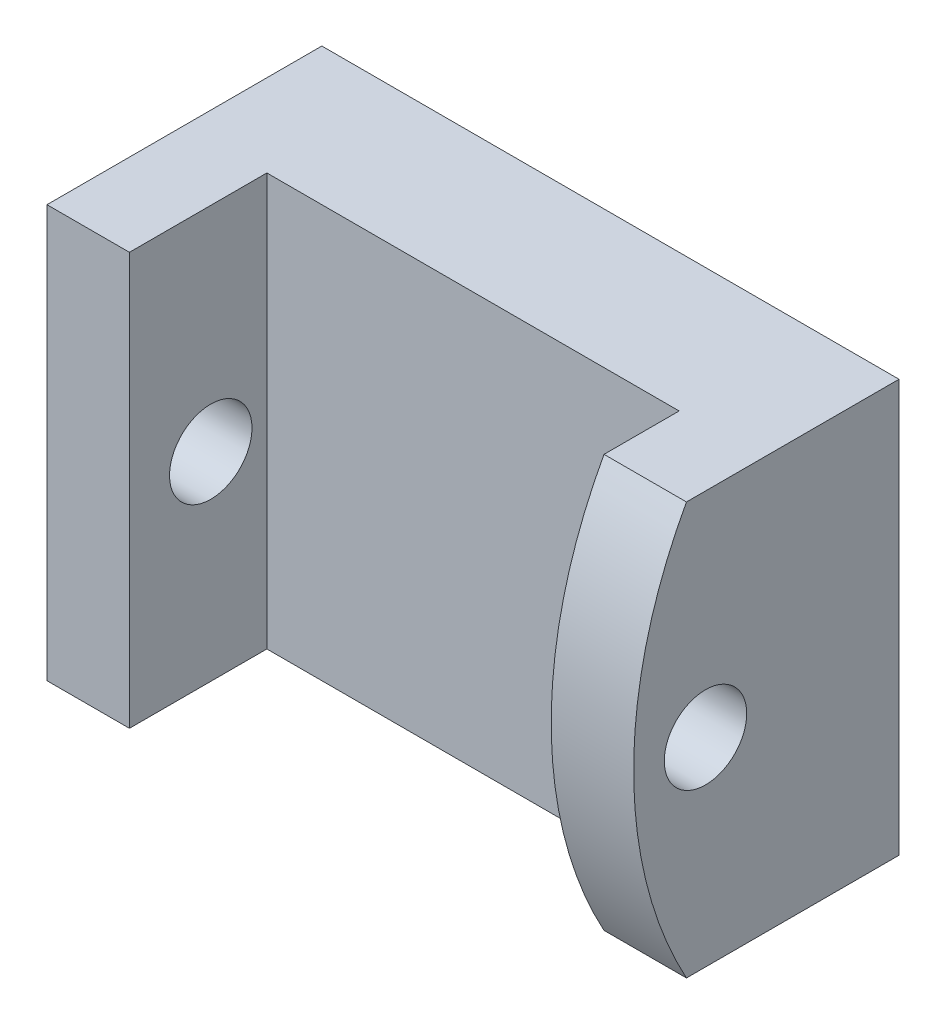
ISO-10303-21;
HEADER;
FILE_DESCRIPTION(('STEP AP214'),'2;1');
FILE_NAME('part.step','',(''),(''),'','','');
FILE_SCHEMA(('AUTOMOTIVE_DESIGN { 1 0 10303 214 1 1 1 1 }'));
ENDSEC;
DATA;
#1=APPLICATION_CONTEXT('core data for automotive mechanical design processes');
#2=APPLICATION_PROTOCOL_DEFINITION('international standard','automotive_design',2000,#1);
#3=PRODUCT_CONTEXT('',#1,'mechanical');
#4=PRODUCT('Part','Part','',(#3));
#5=PRODUCT_RELATED_PRODUCT_CATEGORY('part','',(#4));
#6=PRODUCT_DEFINITION_FORMATION('','',#4);
#7=PRODUCT_DEFINITION_CONTEXT('part definition',#1,'design');
#8=PRODUCT_DEFINITION('design','',#6,#7);
#9=PRODUCT_DEFINITION_SHAPE('','',#8);
#10=(LENGTH_UNIT() NAMED_UNIT(*) SI_UNIT(.MILLI.,.METRE.));
#11=(NAMED_UNIT(*) PLANE_ANGLE_UNIT() SI_UNIT($,.RADIAN.));
#12=(NAMED_UNIT(*) SI_UNIT($,.STERADIAN.) SOLID_ANGLE_UNIT());
#13=UNCERTAINTY_MEASURE_WITH_UNIT(LENGTH_MEASURE(1.E-05),#10,'distance_accuracy_value','');
#14=(GEOMETRIC_REPRESENTATION_CONTEXT(3) GLOBAL_UNCERTAINTY_ASSIGNED_CONTEXT((#13)) GLOBAL_UNIT_ASSIGNED_CONTEXT((#10,
#11,#12)) REPRESENTATION_CONTEXT('',''));
#15=CARTESIAN_POINT('',(0.,0.,0.));
#16=DIRECTION('',(0.,0.,1.));
#17=DIRECTION('',(1.,0.,0.));
#18=AXIS2_PLACEMENT_3D('',#15,#16,#17);
#19=CARTESIAN_POINT('',(0.,0.,5.));
#20=DIRECTION('',(-1.,0.,0.));
#21=DIRECTION('',(0.,0.,1.));
#22=AXIS2_PLACEMENT_3D('',#19,#20,#21);
#23=PLANE('',#22);
#24=CARTESIAN_POINT('',(0.,-7.76248029614629,7.04138911613754));
#25=DIRECTION('',(1.,0.,0.));
#26=DIRECTION('',(0.,0.,-1.));
#27=AXIS2_PLACEMENT_3D('',#24,#25,#26);
#28=CIRCLE('',#27,1.5);
#29=CARTESIAN_POINT('',(0.,-7.76248029614629,5.54138911613754));
#30=VERTEX_POINT('',#29);
#31=EDGE_CURVE('E207',#30,#30,#28,.T.);
#32=ORIENTED_EDGE('',*,*,#31,.F.);
#33=EDGE_LOOP('',(#32));
#34=FACE_BOUND('',#33,.T.);
#35=CARTESIAN_POINT('',(0.,-7.5,-5.94512453601259));
#36=DIRECTION('',(1.,0.,0.));
#37=DIRECTION('',(0.,0.,-1.));
#38=AXIS2_PLACEMENT_3D('',#35,#36,#37);
#39=CIRCLE('',#38,15.5999742941684);
#40=CARTESIAN_POINT('',(0.,0.,7.73366188598822));
#41=VERTEX_POINT('',#40);
#42=CARTESIAN_POINT('',(0.,-15.,7.73366188598822));
#43=VERTEX_POINT('',#42);
#44=EDGE_CURVE('E103',#41,#43,#39,.T.);
#45=ORIENTED_EDGE('',*,*,#44,.T.);
#46=DIRECTION('',(0.,0.,-1.));
#47=VECTOR('',#46,1.);
#48=CARTESIAN_POINT('',(0.,-15.,5.));
#49=LINE('',#48,#47);
#50=CARTESIAN_POINT('',(0.,-15.,0.));
#51=VERTEX_POINT('',#50);
#52=EDGE_CURVE('E120',#43,#51,#49,.T.);
#53=ORIENTED_EDGE('',*,*,#52,.T.);
#54=DIRECTION('',(0.,1.,0.));
#55=VECTOR('',#54,1.);
#56=CARTESIAN_POINT('',(0.,0.,0.));
#57=LINE('',#56,#55);
#58=CARTESIAN_POINT('',(0.,0.,0.));
#59=VERTEX_POINT('',#58);
#60=EDGE_CURVE('E119',#51,#59,#57,.T.);
#61=ORIENTED_EDGE('',*,*,#60,.T.);
#62=DIRECTION('',(0.,0.,-1.));
#63=VECTOR('',#62,1.);
#64=CARTESIAN_POINT('',(0.,0.,5.));
#65=LINE('',#64,#63);
#66=EDGE_CURVE('E11',#41,#59,#65,.T.);
#67=ORIENTED_EDGE('',*,*,#66,.F.);
#68=EDGE_LOOP('',(#45,#53,#61,#67));
#69=FACE_BOUND('',#68,.T.);
#70=ADVANCED_FACE('F39',(#34,#69),#23,.F.);
#71=CARTESIAN_POINT('',(0.,0.,5.));
#72=DIRECTION('',(0.,-1.,0.));
#73=DIRECTION('',(1.,0.,0.));
#74=AXIS2_PLACEMENT_3D('',#71,#72,#73);
#75=PLANE('',#74);
#76=DIRECTION('',(1.,0.,0.));
#77=VECTOR('',#76,1.);
#78=CARTESIAN_POINT('',(-18.,0.,7.73366188598822));
#79=LINE('',#78,#77);
#80=CARTESIAN_POINT('',(-3.,0.,7.73366188598822));
#81=VERTEX_POINT('',#80);
#82=EDGE_CURVE('E54',#81,#41,#79,.T.);
#83=ORIENTED_EDGE('',*,*,#82,.T.);
#84=ORIENTED_EDGE('',*,*,#66,.T.);
#85=DIRECTION('',(-1.,0.,0.));
#86=VECTOR('',#85,1.);
#87=CARTESIAN_POINT('',(0.,0.,0.));
#88=LINE('',#87,#86);
#89=CARTESIAN_POINT('',(-21.,0.,0.));
#90=VERTEX_POINT('',#89);
#91=EDGE_CURVE('E124',#59,#90,#88,.T.);
#92=ORIENTED_EDGE('',*,*,#91,.T.);
#93=DIRECTION('',(0.,0.,-1.));
#94=VECTOR('',#93,1.);
#95=CARTESIAN_POINT('',(-21.,0.,5.));
#96=LINE('',#95,#94);
#97=CARTESIAN_POINT('',(-21.,0.,10.));
#98=VERTEX_POINT('',#97);
#99=EDGE_CURVE('E47',#98,#90,#96,.T.);
#100=ORIENTED_EDGE('',*,*,#99,.F.);
#101=DIRECTION('',(-1.,0.,0.));
#102=VECTOR('',#101,1.);
#103=CARTESIAN_POINT('',(-21.,0.,10.));
#104=LINE('',#103,#102);
#105=CARTESIAN_POINT('',(-18.,0.,10.));
#106=VERTEX_POINT('',#105);
#107=EDGE_CURVE('E163',#106,#98,#104,.T.);
#108=ORIENTED_EDGE('',*,*,#107,.F.);
#109=DIRECTION('',(0.,0.,-1.));
#110=VECTOR('',#109,1.);
#111=CARTESIAN_POINT('',(-18.,0.,10.));
#112=LINE('',#111,#110);
#113=CARTESIAN_POINT('',(-18.,0.,5.));
#114=VERTEX_POINT('',#113);
#115=EDGE_CURVE('E62',#106,#114,#112,.T.);
#116=ORIENTED_EDGE('',*,*,#115,.T.);
#117=DIRECTION('',(-1.,0.,0.));
#118=VECTOR('',#117,1.);
#119=CARTESIAN_POINT('',(0.,0.,5.));
#120=LINE('',#119,#118);
#121=CARTESIAN_POINT('',(-3.,0.,5.));
#122=VERTEX_POINT('',#121);
#123=EDGE_CURVE('E137',#122,#114,#120,.T.);
#124=ORIENTED_EDGE('',*,*,#123,.F.);
#125=DIRECTION('',(0.,0.,-1.));
#126=VECTOR('',#125,1.);
#127=CARTESIAN_POINT('',(-3.,0.,10.));
#128=LINE('',#127,#126);
#129=EDGE_CURVE('E115',#81,#122,#128,.T.);
#130=ORIENTED_EDGE('',*,*,#129,.F.);
#131=EDGE_LOOP('',(#83,#84,#92,#100,#108,#116,#124,#130));
#132=FACE_BOUND('',#131,.T.);
#133=ADVANCED_FACE('F113',(#132),#75,.F.);
#134=CARTESIAN_POINT('',(0.,-15.,5.));
#135=DIRECTION('',(0.,1.,0.));
#136=DIRECTION('',(-1.,0.,0.));
#137=AXIS2_PLACEMENT_3D('',#134,#135,#136);
#138=PLANE('',#137);
#139=DIRECTION('',(1.,0.,0.));
#140=VECTOR('',#139,1.);
#141=CARTESIAN_POINT('',(-18.,-15.,7.73366188598822));
#142=LINE('',#141,#140);
#143=CARTESIAN_POINT('',(-3.,-15.,7.73366188598822));
#144=VERTEX_POINT('',#143);
#145=EDGE_CURVE('E106',#144,#43,#142,.T.);
#146=ORIENTED_EDGE('',*,*,#145,.F.);
#147=DIRECTION('',(0.,0.,-1.));
#148=VECTOR('',#147,1.);
#149=CARTESIAN_POINT('',(-3.,-15.,10.));
#150=LINE('',#149,#148);
#151=CARTESIAN_POINT('',(-3.,-15.,5.));
#152=VERTEX_POINT('',#151);
#153=EDGE_CURVE('E125',#144,#152,#150,.T.);
#154=ORIENTED_EDGE('',*,*,#153,.T.);
#155=DIRECTION('',(1.,0.,0.));
#156=VECTOR('',#155,1.);
#157=CARTESIAN_POINT('',(0.,-15.,5.));
#158=LINE('',#157,#156);
#159=CARTESIAN_POINT('',(-18.,-15.,5.));
#160=VERTEX_POINT('',#159);
#161=EDGE_CURVE('E131',#160,#152,#158,.T.);
#162=ORIENTED_EDGE('',*,*,#161,.F.);
#163=DIRECTION('',(0.,0.,-1.));
#164=VECTOR('',#163,1.);
#165=CARTESIAN_POINT('',(-18.,-15.,10.));
#166=LINE('',#165,#164);
#167=CARTESIAN_POINT('',(-18.,-15.,10.));
#168=VERTEX_POINT('',#167);
#169=EDGE_CURVE('E157',#168,#160,#166,.T.);
#170=ORIENTED_EDGE('',*,*,#169,.F.);
#171=DIRECTION('',(1.,0.,0.));
#172=VECTOR('',#171,1.);
#173=CARTESIAN_POINT('',(-21.,-15.,10.));
#174=LINE('',#173,#172);
#175=CARTESIAN_POINT('',(-21.,-15.,10.));
#176=VERTEX_POINT('',#175);
#177=EDGE_CURVE('E155',#176,#168,#174,.T.);
#178=ORIENTED_EDGE('',*,*,#177,.F.);
#179=DIRECTION('',(0.,0.,-1.));
#180=VECTOR('',#179,1.);
#181=CARTESIAN_POINT('',(-21.,-15.,5.));
#182=LINE('',#181,#180);
#183=CARTESIAN_POINT('',(-21.,-15.,0.));
#184=VERTEX_POINT('',#183);
#185=EDGE_CURVE('E139',#176,#184,#182,.T.);
#186=ORIENTED_EDGE('',*,*,#185,.T.);
#187=DIRECTION('',(1.,0.,0.));
#188=VECTOR('',#187,1.);
#189=CARTESIAN_POINT('',(0.,-15.,0.));
#190=LINE('',#189,#188);
#191=EDGE_CURVE('E135',#184,#51,#190,.T.);
#192=ORIENTED_EDGE('',*,*,#191,.T.);
#193=ORIENTED_EDGE('',*,*,#52,.F.);
#194=EDGE_LOOP('',(#146,#154,#162,#170,#178,#186,#192,#193));
#195=FACE_BOUND('',#194,.T.);
#196=ADVANCED_FACE('F152',(#195),#138,.F.);
#197=CARTESIAN_POINT('',(-3.,0.,10.));
#198=DIRECTION('',(1.,0.,0.));
#199=DIRECTION('',(0.,1.,0.));
#200=AXIS2_PLACEMENT_3D('',#197,#198,#199);
#201=PLANE('',#200);
#202=CARTESIAN_POINT('',(-3.,-7.76248029614629,7.04138911613754));
#203=DIRECTION('',(1.,0.,0.));
#204=DIRECTION('',(0.,1.,0.));
#205=AXIS2_PLACEMENT_3D('',#202,#203,#204);
#206=CIRCLE('',#205,1.5);
#207=CARTESIAN_POINT('',(-3.,-6.26248029614629,7.04138911613754));
#208=VERTEX_POINT('',#207);
#209=EDGE_CURVE('E110',#208,#208,#206,.T.);
#210=ORIENTED_EDGE('',*,*,#209,.T.);
#211=EDGE_LOOP('',(#210));
#212=FACE_BOUND('',#211,.T.);
#213=CARTESIAN_POINT('',(-3.,-7.5,-5.94512453601259));
#214=DIRECTION('',(1.,0.,0.));
#215=DIRECTION('',(0.,1.,0.));
#216=AXIS2_PLACEMENT_3D('',#213,#214,#215);
#217=CIRCLE('',#216,15.5999742941684);
#218=EDGE_CURVE('E181',#81,#144,#217,.T.);
#219=ORIENTED_EDGE('',*,*,#218,.F.);
#220=ORIENTED_EDGE('',*,*,#129,.T.);
#221=DIRECTION('',(0.,-1.,0.));
#222=VECTOR('',#221,1.);
#223=CARTESIAN_POINT('',(-3.,0.,5.));
#224=LINE('',#223,#222);
#225=EDGE_CURVE('E167',#122,#152,#224,.T.);
#226=ORIENTED_EDGE('',*,*,#225,.T.);
#227=ORIENTED_EDGE('',*,*,#153,.F.);
#228=EDGE_LOOP('',(#219,#220,#226,#227));
#229=FACE_BOUND('',#228,.T.);
#230=ADVANCED_FACE('F180',(#212,#229),#201,.F.);
#231=CARTESIAN_POINT('',(0.,0.,5.));
#232=DIRECTION('',(0.,0.,-1.));
#233=DIRECTION('',(-1.,0.,0.));
#234=AXIS2_PLACEMENT_3D('',#231,#232,#233);
#235=PLANE('',#234);
#236=DIRECTION('',(0.,1.,0.));
#237=VECTOR('',#236,1.);
#238=CARTESIAN_POINT('',(-18.,0.,5.));
#239=LINE('',#238,#237);
#240=EDGE_CURVE('E164',#160,#114,#239,.T.);
#241=ORIENTED_EDGE('',*,*,#240,.F.);
#242=ORIENTED_EDGE('',*,*,#161,.T.);
#243=ORIENTED_EDGE('',*,*,#225,.F.);
#244=ORIENTED_EDGE('',*,*,#123,.T.);
#245=EDGE_LOOP('',(#241,#242,#243,#244));
#246=FACE_BOUND('',#245,.T.);
#247=ADVANCED_FACE('F177',(#246),#235,.F.);
#248=CARTESIAN_POINT('',(-21.,0.,5.));
#249=DIRECTION('',(1.,0.,0.));
#250=DIRECTION('',(0.,1.,0.));
#251=AXIS2_PLACEMENT_3D('',#248,#249,#250);
#252=PLANE('',#251);
#253=CARTESIAN_POINT('',(-21.,-7.76248029614629,7.04138911613754));
#254=DIRECTION('',(1.,0.,0.));
#255=DIRECTION('',(0.,0.,-1.));
#256=AXIS2_PLACEMENT_3D('',#253,#254,#255);
#257=CIRCLE('',#256,1.5);
#258=CARTESIAN_POINT('',(-21.,-7.76248029614629,5.54138911613754));
#259=VERTEX_POINT('',#258);
#260=EDGE_CURVE('E209',#259,#259,#257,.T.);
#261=ORIENTED_EDGE('',*,*,#260,.T.);
#262=EDGE_LOOP('',(#261));
#263=FACE_BOUND('',#262,.T.);
#264=DIRECTION('',(0.,-1.,0.));
#265=VECTOR('',#264,1.);
#266=CARTESIAN_POINT('',(-21.,0.,0.));
#267=LINE('',#266,#265);
#268=EDGE_CURVE('E127',#90,#184,#267,.T.);
#269=ORIENTED_EDGE('',*,*,#268,.T.);
#270=ORIENTED_EDGE('',*,*,#185,.F.);
#271=DIRECTION('',(0.,-1.,0.));
#272=VECTOR('',#271,1.);
#273=CARTESIAN_POINT('',(-21.,0.,10.));
#274=LINE('',#273,#272);
#275=EDGE_CURVE('E148',#98,#176,#274,.T.);
#276=ORIENTED_EDGE('',*,*,#275,.F.);
#277=ORIENTED_EDGE('',*,*,#99,.T.);
#278=EDGE_LOOP('',(#269,#270,#276,#277));
#279=FACE_BOUND('',#278,.T.);
#280=ADVANCED_FACE('F146',(#263,#279),#252,.F.);
#281=CARTESIAN_POINT('',(0.,0.,0.));
#282=DIRECTION('',(0.,0.,-1.));
#283=DIRECTION('',(-1.,0.,0.));
#284=AXIS2_PLACEMENT_3D('',#281,#282,#283);
#285=PLANE('',#284);
#286=ORIENTED_EDGE('',*,*,#60,.F.);
#287=ORIENTED_EDGE('',*,*,#191,.F.);
#288=ORIENTED_EDGE('',*,*,#268,.F.);
#289=ORIENTED_EDGE('',*,*,#91,.F.);
#290=EDGE_LOOP('',(#286,#287,#288,#289));
#291=FACE_BOUND('',#290,.T.);
#292=ADVANCED_FACE('F150',(#291),#285,.T.);
#293=CARTESIAN_POINT('',(-18.,0.,10.));
#294=DIRECTION('',(-1.,0.,0.));
#295=DIRECTION('',(0.,0.,1.));
#296=AXIS2_PLACEMENT_3D('',#293,#294,#295);
#297=PLANE('',#296);
#298=CARTESIAN_POINT('',(-18.,-7.76248029614629,7.04138911613754));
#299=DIRECTION('',(-1.,0.,0.));
#300=DIRECTION('',(0.,0.,1.));
#301=AXIS2_PLACEMENT_3D('',#298,#299,#300);
#302=CIRCLE('',#301,1.5);
#303=CARTESIAN_POINT('',(-18.,-7.76248029614629,8.54138911613754));
#304=VERTEX_POINT('',#303);
#305=EDGE_CURVE('E42',#304,#304,#302,.T.);
#306=ORIENTED_EDGE('',*,*,#305,.T.);
#307=EDGE_LOOP('',(#306));
#308=FACE_BOUND('',#307,.T.);
#309=ORIENTED_EDGE('',*,*,#169,.T.);
#310=ORIENTED_EDGE('',*,*,#240,.T.);
#311=ORIENTED_EDGE('',*,*,#115,.F.);
#312=DIRECTION('',(0.,1.,0.));
#313=VECTOR('',#312,1.);
#314=CARTESIAN_POINT('',(-18.,0.,10.));
#315=LINE('',#314,#313);
#316=EDGE_CURVE('E160',#168,#106,#315,.T.);
#317=ORIENTED_EDGE('',*,*,#316,.F.);
#318=EDGE_LOOP('',(#309,#310,#311,#317));
#319=FACE_BOUND('',#318,.T.);
#320=ADVANCED_FACE('F188',(#308,#319),#297,.F.);
#321=CARTESIAN_POINT('',(0.,0.,10.));
#322=DIRECTION('',(0.,0.,1.));
#323=DIRECTION('',(1.,0.,0.));
#324=AXIS2_PLACEMENT_3D('',#321,#322,#323);
#325=PLANE('',#324);
#326=ORIENTED_EDGE('',*,*,#275,.T.);
#327=ORIENTED_EDGE('',*,*,#177,.T.);
#328=ORIENTED_EDGE('',*,*,#316,.T.);
#329=ORIENTED_EDGE('',*,*,#107,.T.);
#330=EDGE_LOOP('',(#326,#327,#328,#329));
#331=FACE_BOUND('',#330,.T.);
#332=ADVANCED_FACE('F162',(#331),#325,.T.);
#333=CARTESIAN_POINT('',(-18.,-7.5,-5.94512453601259));
#334=DIRECTION('',(1.,0.,0.));
#335=DIRECTION('',(0.,0.,-1.));
#336=AXIS2_PLACEMENT_3D('',#333,#334,#335);
#337=CYLINDRICAL_SURFACE('',#336,15.5999742941684);
#338=ORIENTED_EDGE('',*,*,#218,.T.);
#339=ORIENTED_EDGE('',*,*,#145,.T.);
#340=ORIENTED_EDGE('',*,*,#44,.F.);
#341=ORIENTED_EDGE('',*,*,#82,.F.);
#342=EDGE_LOOP('',(#338,#339,#340,#341));
#343=FACE_BOUND('',#342,.T.);
#344=ADVANCED_FACE('F104',(#343),#337,.T.);
#345=CARTESIAN_POINT('',(-21.,-7.76248029614629,7.04138911613754));
#346=DIRECTION('',(1.,0.,0.));
#347=DIRECTION('',(0.,0.,-1.));
#348=AXIS2_PLACEMENT_3D('',#345,#346,#347);
#349=CYLINDRICAL_SURFACE('',#348,1.5);
#350=ORIENTED_EDGE('',*,*,#260,.F.);
#351=EDGE_LOOP('',(#350));
#352=FACE_BOUND('',#351,.T.);
#353=ORIENTED_EDGE('',*,*,#305,.F.);
#354=EDGE_LOOP('',(#353));
#355=FACE_BOUND('',#354,.T.);
#356=ADVANCED_FACE('F219',(#352,#355),#349,.F.);
#357=ORIENTED_EDGE('',*,*,#31,.T.);
#358=EDGE_LOOP('',(#357));
#359=FACE_BOUND('',#358,.T.);
#360=ORIENTED_EDGE('',*,*,#209,.F.);
#361=EDGE_LOOP('',(#360));
#362=FACE_BOUND('',#361,.T.);
#363=ADVANCED_FACE('F221',(#359,#362),#349,.F.);
#364=CLOSED_SHELL('',(#70,#133,#196,#230,#247,#280,#292,#320,#332,#344,#356,#363));
#365=MANIFOLD_SOLID_BREP('B2',#364);
#366=ADVANCED_BREP_SHAPE_REPRESENTATION('',(#18,#365),#14);
#367=SHAPE_DEFINITION_REPRESENTATION(#9,#366);
ENDSEC;
END-ISO-10303-21;
